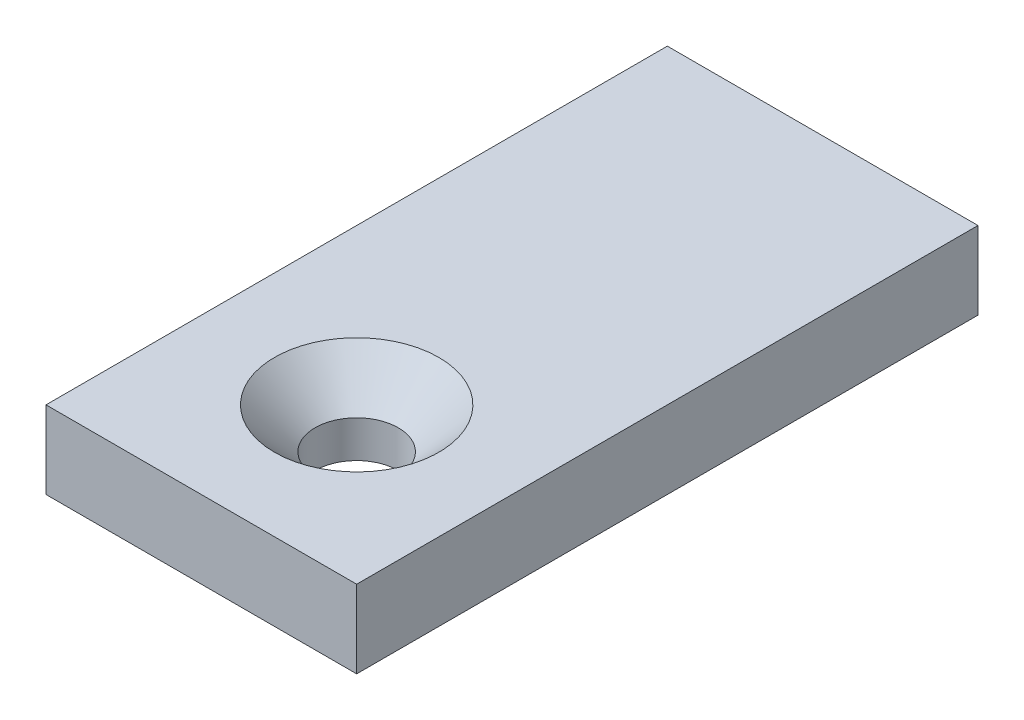
ISO-10303-21;
HEADER;
FILE_DESCRIPTION(('STEP AP214'),'2;1');
FILE_NAME('part.step','',(''),(''),'','','');
FILE_SCHEMA(('AUTOMOTIVE_DESIGN { 1 0 10303 214 1 1 1 1 }'));
ENDSEC;
DATA;
#1=APPLICATION_CONTEXT('core data for automotive mechanical design processes');
#2=APPLICATION_PROTOCOL_DEFINITION('international standard','automotive_design',2000,#1);
#3=PRODUCT_CONTEXT('',#1,'mechanical');
#4=PRODUCT('Part','Part','',(#3));
#5=PRODUCT_RELATED_PRODUCT_CATEGORY('part','',(#4));
#6=PRODUCT_DEFINITION_FORMATION('','',#4);
#7=PRODUCT_DEFINITION_CONTEXT('part definition',#1,'design');
#8=PRODUCT_DEFINITION('design','',#6,#7);
#9=PRODUCT_DEFINITION_SHAPE('','',#8);
#10=(LENGTH_UNIT() NAMED_UNIT(*) SI_UNIT(.MILLI.,.METRE.));
#11=(NAMED_UNIT(*) PLANE_ANGLE_UNIT() SI_UNIT($,.RADIAN.));
#12=(NAMED_UNIT(*) SI_UNIT($,.STERADIAN.) SOLID_ANGLE_UNIT());
#13=UNCERTAINTY_MEASURE_WITH_UNIT(LENGTH_MEASURE(1.E-05),#10,'distance_accuracy_value','');
#14=(GEOMETRIC_REPRESENTATION_CONTEXT(3) GLOBAL_UNCERTAINTY_ASSIGNED_CONTEXT((#13)) GLOBAL_UNIT_ASSIGNED_CONTEXT((#10,
#11,#12)) REPRESENTATION_CONTEXT('',''));
#15=CARTESIAN_POINT('',(0.,0.,0.));
#16=DIRECTION('',(0.,0.,1.));
#17=DIRECTION('',(1.,0.,0.));
#18=AXIS2_PLACEMENT_3D('',#15,#16,#17);
#19=CARTESIAN_POINT('',(0.,3.175,0.));
#20=DIRECTION('',(1.,0.,0.));
#21=DIRECTION('',(0.,0.,-1.));
#22=AXIS2_PLACEMENT_3D('',#19,#20,#21);
#23=PLANE('',#22);
#24=DIRECTION('',(0.,0.,1.));
#25=VECTOR('',#24,1.);
#26=CARTESIAN_POINT('',(0.,0.,0.));
#27=LINE('',#26,#25);
#28=CARTESIAN_POINT('',(0.,0.,-25.4));
#29=VERTEX_POINT('',#28);
#30=CARTESIAN_POINT('',(0.,0.,0.));
#31=VERTEX_POINT('',#30);
#32=EDGE_CURVE('E98',#29,#31,#27,.T.);
#33=ORIENTED_EDGE('',*,*,#32,.T.);
#34=DIRECTION('',(0.,-1.,0.));
#35=VECTOR('',#34,1.);
#36=CARTESIAN_POINT('',(0.,3.175,0.));
#37=LINE('',#36,#35);
#38=CARTESIAN_POINT('',(0.,3.175,0.));
#39=VERTEX_POINT('',#38);
#40=EDGE_CURVE('E11',#39,#31,#37,.T.);
#41=ORIENTED_EDGE('',*,*,#40,.F.);
#42=DIRECTION('',(0.,0.,1.));
#43=VECTOR('',#42,1.);
#44=CARTESIAN_POINT('',(0.,3.175,0.));
#45=LINE('',#44,#43);
#46=CARTESIAN_POINT('',(0.,3.175,-25.4));
#47=VERTEX_POINT('',#46);
#48=EDGE_CURVE('E86',#47,#39,#45,.T.);
#49=ORIENTED_EDGE('',*,*,#48,.F.);
#50=DIRECTION('',(0.,-1.,0.));
#51=VECTOR('',#50,1.);
#52=CARTESIAN_POINT('',(0.,3.175,-25.4));
#53=LINE('',#52,#51);
#54=EDGE_CURVE('E94',#47,#29,#53,.T.);
#55=ORIENTED_EDGE('',*,*,#54,.T.);
#56=EDGE_LOOP('',(#33,#41,#49,#55));
#57=FACE_BOUND('',#56,.T.);
#58=ADVANCED_FACE('F35',(#57),#23,.F.);
#59=CARTESIAN_POINT('',(0.,3.175,0.));
#60=DIRECTION('',(0.,0.,-1.));
#61=DIRECTION('',(-1.,0.,0.));
#62=AXIS2_PLACEMENT_3D('',#59,#60,#61);
#63=PLANE('',#62);
#64=DIRECTION('',(1.,0.,0.));
#65=VECTOR('',#64,1.);
#66=CARTESIAN_POINT('',(0.,0.,0.));
#67=LINE('',#66,#65);
#68=CARTESIAN_POINT('',(12.7,0.,0.));
#69=VERTEX_POINT('',#68);
#70=EDGE_CURVE('E90',#31,#69,#67,.T.);
#71=ORIENTED_EDGE('',*,*,#70,.T.);
#72=DIRECTION('',(0.,-1.,0.));
#73=VECTOR('',#72,1.);
#74=CARTESIAN_POINT('',(12.7,3.175,0.));
#75=LINE('',#74,#73);
#76=CARTESIAN_POINT('',(12.7,3.175,0.));
#77=VERTEX_POINT('',#76);
#78=EDGE_CURVE('E43',#77,#69,#75,.T.);
#79=ORIENTED_EDGE('',*,*,#78,.F.);
#80=DIRECTION('',(1.,0.,0.));
#81=VECTOR('',#80,1.);
#82=CARTESIAN_POINT('',(0.,3.175,0.));
#83=LINE('',#82,#81);
#84=EDGE_CURVE('E81',#39,#77,#83,.T.);
#85=ORIENTED_EDGE('',*,*,#84,.F.);
#86=ORIENTED_EDGE('',*,*,#40,.T.);
#87=EDGE_LOOP('',(#71,#79,#85,#86));
#88=FACE_BOUND('',#87,.T.);
#89=ADVANCED_FACE('F89',(#88),#63,.F.);
#90=CARTESIAN_POINT('',(12.7,3.175,0.));
#91=DIRECTION('',(-1.,0.,0.));
#92=DIRECTION('',(0.,0.,1.));
#93=AXIS2_PLACEMENT_3D('',#90,#91,#92);
#94=PLANE('',#93);
#95=DIRECTION('',(0.,0.,-1.));
#96=VECTOR('',#95,1.);
#97=CARTESIAN_POINT('',(12.7,0.,0.));
#98=LINE('',#97,#96);
#99=CARTESIAN_POINT('',(12.7,0.,-25.4));
#100=VERTEX_POINT('',#99);
#101=EDGE_CURVE('E68',#69,#100,#98,.T.);
#102=ORIENTED_EDGE('',*,*,#101,.T.);
#103=DIRECTION('',(0.,-1.,0.));
#104=VECTOR('',#103,1.);
#105=CARTESIAN_POINT('',(12.7,3.175,-25.4));
#106=LINE('',#105,#104);
#107=CARTESIAN_POINT('',(12.7,3.175,-25.4));
#108=VERTEX_POINT('',#107);
#109=EDGE_CURVE('E91',#108,#100,#106,.T.);
#110=ORIENTED_EDGE('',*,*,#109,.F.);
#111=DIRECTION('',(0.,0.,-1.));
#112=VECTOR('',#111,1.);
#113=CARTESIAN_POINT('',(12.7,3.175,0.));
#114=LINE('',#113,#112);
#115=EDGE_CURVE('E84',#77,#108,#114,.T.);
#116=ORIENTED_EDGE('',*,*,#115,.F.);
#117=ORIENTED_EDGE('',*,*,#78,.T.);
#118=EDGE_LOOP('',(#102,#110,#116,#117));
#119=FACE_BOUND('',#118,.T.);
#120=ADVANCED_FACE('F92',(#119),#94,.F.);
#121=CARTESIAN_POINT('',(0.,3.175,-25.4));
#122=DIRECTION('',(0.,0.,1.));
#123=DIRECTION('',(1.,0.,0.));
#124=AXIS2_PLACEMENT_3D('',#121,#122,#123);
#125=PLANE('',#124);
#126=DIRECTION('',(-1.,0.,0.));
#127=VECTOR('',#126,1.);
#128=CARTESIAN_POINT('',(0.,0.,-25.4));
#129=LINE('',#128,#127);
#130=EDGE_CURVE('E74',#100,#29,#129,.T.);
#131=ORIENTED_EDGE('',*,*,#130,.T.);
#132=ORIENTED_EDGE('',*,*,#54,.F.);
#133=DIRECTION('',(-1.,0.,0.));
#134=VECTOR('',#133,1.);
#135=CARTESIAN_POINT('',(0.,3.175,-25.4));
#136=LINE('',#135,#134);
#137=EDGE_CURVE('E51',#108,#47,#136,.T.);
#138=ORIENTED_EDGE('',*,*,#137,.F.);
#139=ORIENTED_EDGE('',*,*,#109,.T.);
#140=EDGE_LOOP('',(#131,#132,#138,#139));
#141=FACE_BOUND('',#140,.T.);
#142=ADVANCED_FACE('F106',(#141),#125,.F.);
#143=CARTESIAN_POINT('',(0.,3.175,0.));
#144=DIRECTION('',(0.,-1.,0.));
#145=DIRECTION('',(0.,0.,-1.));
#146=AXIS2_PLACEMENT_3D('',#143,#144,#145);
#147=PLANE('',#146);
#148=CARTESIAN_POINT('',(6.35,3.175,-6.35));
#149=DIRECTION('',(0.,1.,0.));
#150=DIRECTION('',(0.,0.,1.));
#151=AXIS2_PLACEMENT_3D('',#148,#149,#150);
#152=CIRCLE('',#151,3.36);
#153=CARTESIAN_POINT('',(6.35,3.175,-2.99));
#154=VERTEX_POINT('',#153);
#155=EDGE_CURVE('E117',#154,#154,#152,.T.);
#156=ORIENTED_EDGE('',*,*,#155,.F.);
#157=EDGE_LOOP('',(#156));
#158=FACE_BOUND('',#157,.T.);
#159=ORIENTED_EDGE('',*,*,#48,.T.);
#160=ORIENTED_EDGE('',*,*,#84,.T.);
#161=ORIENTED_EDGE('',*,*,#115,.T.);
#162=ORIENTED_EDGE('',*,*,#137,.T.);
#163=EDGE_LOOP('',(#159,#160,#161,#162));
#164=FACE_BOUND('',#163,.T.);
#165=ADVANCED_FACE('F82',(#158,#164),#147,.F.);
#166=CARTESIAN_POINT('',(0.,0.,0.));
#167=DIRECTION('',(0.,-1.,0.));
#168=DIRECTION('',(0.,0.,-1.));
#169=AXIS2_PLACEMENT_3D('',#166,#167,#168);
#170=PLANE('',#169);
#171=CARTESIAN_POINT('',(6.35,0.,-6.35));
#172=DIRECTION('',(0.,1.,0.));
#173=DIRECTION('',(0.,0.,1.));
#174=AXIS2_PLACEMENT_3D('',#171,#172,#173);
#175=CIRCLE('',#174,1.7);
#176=CARTESIAN_POINT('',(6.35,0.,-4.65));
#177=VERTEX_POINT('',#176);
#178=EDGE_CURVE('E101',#177,#177,#175,.T.);
#179=ORIENTED_EDGE('',*,*,#178,.T.);
#180=EDGE_LOOP('',(#179));
#181=FACE_BOUND('',#180,.T.);
#182=ORIENTED_EDGE('',*,*,#32,.F.);
#183=ORIENTED_EDGE('',*,*,#130,.F.);
#184=ORIENTED_EDGE('',*,*,#101,.F.);
#185=ORIENTED_EDGE('',*,*,#70,.F.);
#186=EDGE_LOOP('',(#182,#183,#184,#185));
#187=FACE_BOUND('',#186,.T.);
#188=ADVANCED_FACE('F109',(#181,#187),#170,.T.);
#189=CARTESIAN_POINT('',(6.35,3.175,-6.35));
#190=DIRECTION('',(0.,1.,0.));
#191=DIRECTION('',(0.,0.,1.));
#192=AXIS2_PLACEMENT_3D('',#189,#190,#191);
#193=CYLINDRICAL_SURFACE('',#192,1.69999999999999);
#194=ORIENTED_EDGE('',*,*,#178,.F.);
#195=EDGE_LOOP('',(#194));
#196=FACE_BOUND('',#195,.T.);
#197=CARTESIAN_POINT('',(6.35,1.51499999999998,-6.35));
#198=DIRECTION('',(0.,1.,0.));
#199=DIRECTION('',(0.,0.,1.));
#200=AXIS2_PLACEMENT_3D('',#197,#198,#199);
#201=CIRCLE('',#200,1.69999999999999);
#202=CARTESIAN_POINT('',(6.35,1.51499999999998,-4.65000000000001));
#203=VERTEX_POINT('',#202);
#204=EDGE_CURVE('E114',#203,#203,#201,.T.);
#205=ORIENTED_EDGE('',*,*,#204,.T.);
#206=EDGE_LOOP('',(#205));
#207=FACE_BOUND('',#206,.T.);
#208=ADVANCED_FACE('F129',(#196,#207),#193,.F.);
#209=CARTESIAN_POINT('',(6.35,3.175,-6.35));
#210=DIRECTION('',(0.,1.,0.));
#211=DIRECTION('',(0.,0.,1.));
#212=AXIS2_PLACEMENT_3D('',#209,#210,#211);
#213=CONICAL_SURFACE('',#212,3.36,0.785398163397445);
#214=ORIENTED_EDGE('',*,*,#204,.F.);
#215=EDGE_LOOP('',(#214));
#216=FACE_BOUND('',#215,.T.);
#217=ORIENTED_EDGE('',*,*,#155,.T.);
#218=EDGE_LOOP('',(#217));
#219=FACE_BOUND('',#218,.T.);
#220=ADVANCED_FACE('F121',(#216,#219),#213,.F.);
#221=CLOSED_SHELL('',(#58,#89,#120,#142,#165,#188,#208,#220));
#222=MANIFOLD_SOLID_BREP('B2',#221);
#223=ADVANCED_BREP_SHAPE_REPRESENTATION('',(#18,#222),#14);
#224=SHAPE_DEFINITION_REPRESENTATION(#9,#223);
ENDSEC;
END-ISO-10303-21;
